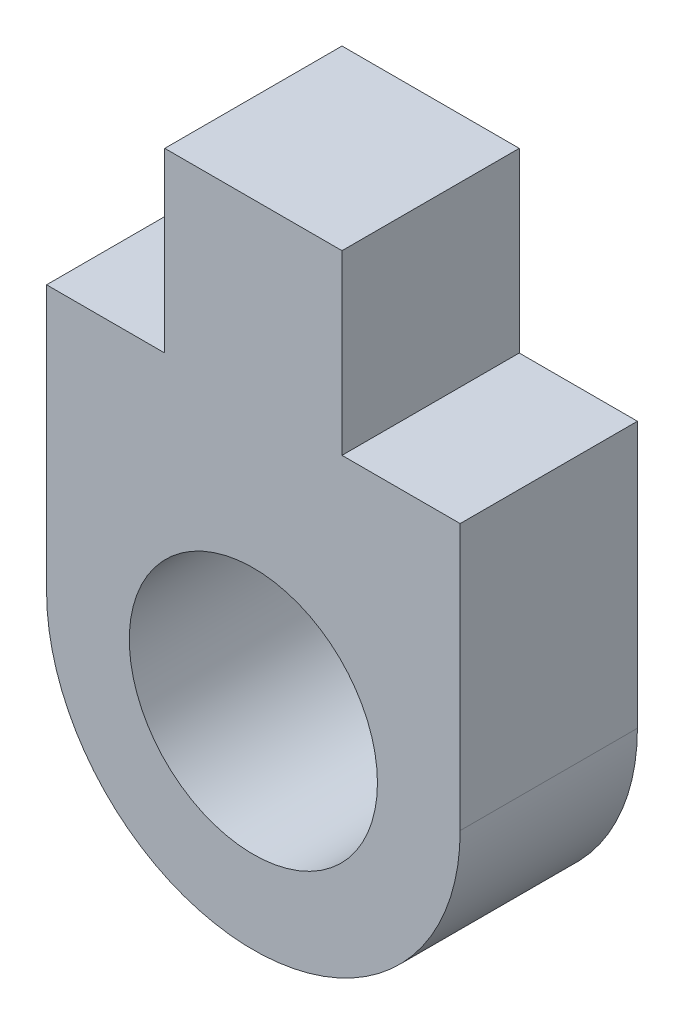
ISO-10303-21;
HEADER;
FILE_DESCRIPTION(('STEP AP214'),'2;1');
FILE_NAME('part.step','',(''),(''),'','','');
FILE_SCHEMA(('AUTOMOTIVE_DESIGN { 1 0 10303 214 1 1 1 1 }'));
ENDSEC;
DATA;
#1=APPLICATION_CONTEXT('core data for automotive mechanical design processes');
#2=APPLICATION_PROTOCOL_DEFINITION('international standard','automotive_design',2000,#1);
#3=PRODUCT_CONTEXT('',#1,'mechanical');
#4=PRODUCT('Part','Part','',(#3));
#5=PRODUCT_RELATED_PRODUCT_CATEGORY('part','',(#4));
#6=PRODUCT_DEFINITION_FORMATION('','',#4);
#7=PRODUCT_DEFINITION_CONTEXT('part definition',#1,'design');
#8=PRODUCT_DEFINITION('design','',#6,#7);
#9=PRODUCT_DEFINITION_SHAPE('','',#8);
#10=(LENGTH_UNIT() NAMED_UNIT(*) SI_UNIT(.MILLI.,.METRE.));
#11=(NAMED_UNIT(*) PLANE_ANGLE_UNIT() SI_UNIT($,.RADIAN.));
#12=(NAMED_UNIT(*) SI_UNIT($,.STERADIAN.) SOLID_ANGLE_UNIT());
#13=UNCERTAINTY_MEASURE_WITH_UNIT(LENGTH_MEASURE(1.E-05),#10,'distance_accuracy_value','');
#14=(GEOMETRIC_REPRESENTATION_CONTEXT(3) GLOBAL_UNCERTAINTY_ASSIGNED_CONTEXT((#13)) GLOBAL_UNIT_ASSIGNED_CONTEXT((#10,
#11,#12)) REPRESENTATION_CONTEXT('',''));
#15=CARTESIAN_POINT('',(0.,0.,0.));
#16=DIRECTION('',(0.,0.,1.));
#17=DIRECTION('',(1.,0.,0.));
#18=AXIS2_PLACEMENT_3D('',#15,#16,#17);
#19=CARTESIAN_POINT('',(-0.0999999999999996,-0.300000000000004,3.));
#20=DIRECTION('',(0.,0.,1.));
#21=DIRECTION('',(1.,0.,0.));
#22=AXIS2_PLACEMENT_3D('',#19,#20,#21);
#23=PLANE('',#22);
#24=CARTESIAN_POINT('',(-0.0999999999999996,-0.300000000000004,3.));
#25=DIRECTION('',(0.,0.,1.));
#26=DIRECTION('',(1.,0.,0.));
#27=AXIS2_PLACEMENT_3D('',#24,#25,#26);
#28=CIRCLE('',#27,3.5);
#29=CARTESIAN_POINT('',(-3.6,-0.300000000000004,3.));
#30=VERTEX_POINT('',#29);
#31=CARTESIAN_POINT('',(3.4,-0.300000000000004,3.));
#32=VERTEX_POINT('',#31);
#33=EDGE_CURVE('E145',#30,#32,#28,.T.);
#34=ORIENTED_EDGE('',*,*,#33,.T.);
#35=DIRECTION('',(0.,1.,0.));
#36=VECTOR('',#35,1.);
#37=CARTESIAN_POINT('',(3.4,-0.300000000000004,3.));
#38=LINE('',#37,#36);
#39=CARTESIAN_POINT('',(3.4,4.2,3.));
#40=VERTEX_POINT('',#39);
#41=EDGE_CURVE('E93',#32,#40,#38,.T.);
#42=ORIENTED_EDGE('',*,*,#41,.T.);
#43=DIRECTION('',(-1.,0.,0.));
#44=VECTOR('',#43,1.);
#45=CARTESIAN_POINT('',(3.4,4.2,3.));
#46=LINE('',#45,#44);
#47=CARTESIAN_POINT('',(1.4,4.2,3.));
#48=VERTEX_POINT('',#47);
#49=EDGE_CURVE('E160',#40,#48,#46,.T.);
#50=ORIENTED_EDGE('',*,*,#49,.T.);
#51=DIRECTION('',(0.,1.,0.));
#52=VECTOR('',#51,1.);
#53=CARTESIAN_POINT('',(1.4,4.2,3.));
#54=LINE('',#53,#52);
#55=CARTESIAN_POINT('',(1.4,7.2,3.));
#56=VERTEX_POINT('',#55);
#57=EDGE_CURVE('E173',#48,#56,#54,.T.);
#58=ORIENTED_EDGE('',*,*,#57,.T.);
#59=DIRECTION('',(-1.,0.,0.));
#60=VECTOR('',#59,1.);
#61=CARTESIAN_POINT('',(1.4,7.2,3.));
#62=LINE('',#61,#60);
#63=CARTESIAN_POINT('',(-1.6,7.2,3.));
#64=VERTEX_POINT('',#63);
#65=EDGE_CURVE('E112',#56,#64,#62,.T.);
#66=ORIENTED_EDGE('',*,*,#65,.T.);
#67=DIRECTION('',(0.,-1.,0.));
#68=VECTOR('',#67,1.);
#69=CARTESIAN_POINT('',(-1.6,4.2,3.));
#70=LINE('',#69,#68);
#71=CARTESIAN_POINT('',(-1.6,4.2,3.));
#72=VERTEX_POINT('',#71);
#73=EDGE_CURVE('E106',#64,#72,#70,.T.);
#74=ORIENTED_EDGE('',*,*,#73,.T.);
#75=DIRECTION('',(-1.,0.,0.));
#76=VECTOR('',#75,1.);
#77=CARTESIAN_POINT('',(-3.6,4.2,3.));
#78=LINE('',#77,#76);
#79=CARTESIAN_POINT('',(-3.6,4.2,3.));
#80=VERTEX_POINT('',#79);
#81=EDGE_CURVE('E110',#72,#80,#78,.T.);
#82=ORIENTED_EDGE('',*,*,#81,.T.);
#83=DIRECTION('',(0.,-1.,0.));
#84=VECTOR('',#83,1.);
#85=CARTESIAN_POINT('',(-3.6,4.2,3.));
#86=LINE('',#85,#84);
#87=EDGE_CURVE('E50',#80,#30,#86,.T.);
#88=ORIENTED_EDGE('',*,*,#87,.T.);
#89=EDGE_LOOP('',(#34,#42,#50,#58,#66,#74,#82,#88));
#90=FACE_BOUND('',#89,.T.);
#91=CARTESIAN_POINT('',(-0.0999999999999996,-0.300000000000004,3.));
#92=DIRECTION('',(0.,0.,1.));
#93=DIRECTION('',(1.,0.,0.));
#94=AXIS2_PLACEMENT_3D('',#91,#92,#93);
#95=CIRCLE('',#94,2.1);
#96=CARTESIAN_POINT('',(2.,-0.300000000000004,3.));
#97=VERTEX_POINT('',#96);
#98=EDGE_CURVE('E134',#97,#97,#95,.T.);
#99=ORIENTED_EDGE('',*,*,#98,.F.);
#100=EDGE_LOOP('',(#99));
#101=FACE_BOUND('',#100,.T.);
#102=ADVANCED_FACE('F33',(#90,#101),#23,.T.);
#103=CARTESIAN_POINT('',(-0.0999999999999996,-0.300000000000004,0.));
#104=DIRECTION('',(0.,0.,1.));
#105=DIRECTION('',(1.,0.,0.));
#106=AXIS2_PLACEMENT_3D('',#103,#104,#105);
#107=PLANE('',#106);
#108=CARTESIAN_POINT('',(-0.0999999999999996,-0.300000000000004,0.));
#109=DIRECTION('',(0.,0.,1.));
#110=DIRECTION('',(1.,0.,0.));
#111=AXIS2_PLACEMENT_3D('',#108,#109,#110);
#112=CIRCLE('',#111,3.5);
#113=CARTESIAN_POINT('',(-3.6,-0.300000000000004,0.));
#114=VERTEX_POINT('',#113);
#115=CARTESIAN_POINT('',(3.4,-0.300000000000004,0.));
#116=VERTEX_POINT('',#115);
#117=EDGE_CURVE('E130',#114,#116,#112,.T.);
#118=ORIENTED_EDGE('',*,*,#117,.F.);
#119=DIRECTION('',(0.,-1.,0.));
#120=VECTOR('',#119,1.);
#121=CARTESIAN_POINT('',(-3.6,4.2,0.));
#122=LINE('',#121,#120);
#123=CARTESIAN_POINT('',(-3.6,4.2,0.));
#124=VERTEX_POINT('',#123);
#125=EDGE_CURVE('E85',#124,#114,#122,.T.);
#126=ORIENTED_EDGE('',*,*,#125,.F.);
#127=DIRECTION('',(-1.,0.,0.));
#128=VECTOR('',#127,1.);
#129=CARTESIAN_POINT('',(-3.6,4.2,0.));
#130=LINE('',#129,#128);
#131=CARTESIAN_POINT('',(-1.6,4.2,0.));
#132=VERTEX_POINT('',#131);
#133=EDGE_CURVE('E79',#132,#124,#130,.T.);
#134=ORIENTED_EDGE('',*,*,#133,.F.);
#135=DIRECTION('',(0.,-1.,0.));
#136=VECTOR('',#135,1.);
#137=CARTESIAN_POINT('',(-1.6,4.2,0.));
#138=LINE('',#137,#136);
#139=CARTESIAN_POINT('',(-1.6,7.2,0.));
#140=VERTEX_POINT('',#139);
#141=EDGE_CURVE('E120',#140,#132,#138,.T.);
#142=ORIENTED_EDGE('',*,*,#141,.F.);
#143=DIRECTION('',(-1.,0.,0.));
#144=VECTOR('',#143,1.);
#145=CARTESIAN_POINT('',(1.4,7.2,0.));
#146=LINE('',#145,#144);
#147=CARTESIAN_POINT('',(1.4,7.2,0.));
#148=VERTEX_POINT('',#147);
#149=EDGE_CURVE('E140',#148,#140,#146,.T.);
#150=ORIENTED_EDGE('',*,*,#149,.F.);
#151=DIRECTION('',(0.,1.,0.));
#152=VECTOR('',#151,1.);
#153=CARTESIAN_POINT('',(1.4,4.2,0.));
#154=LINE('',#153,#152);
#155=CARTESIAN_POINT('',(1.4,4.2,0.));
#156=VERTEX_POINT('',#155);
#157=EDGE_CURVE('E138',#156,#148,#154,.T.);
#158=ORIENTED_EDGE('',*,*,#157,.F.);
#159=DIRECTION('',(-1.,0.,0.));
#160=VECTOR('',#159,1.);
#161=CARTESIAN_POINT('',(3.4,4.2,0.));
#162=LINE('',#161,#160);
#163=CARTESIAN_POINT('',(3.4,4.2,0.));
#164=VERTEX_POINT('',#163);
#165=EDGE_CURVE('E136',#164,#156,#162,.T.);
#166=ORIENTED_EDGE('',*,*,#165,.F.);
#167=DIRECTION('',(0.,1.,0.));
#168=VECTOR('',#167,1.);
#169=CARTESIAN_POINT('',(3.4,-0.300000000000004,0.));
#170=LINE('',#169,#168);
#171=EDGE_CURVE('E133',#116,#164,#170,.T.);
#172=ORIENTED_EDGE('',*,*,#171,.F.);
#173=EDGE_LOOP('',(#118,#126,#134,#142,#150,#158,#166,#172));
#174=FACE_BOUND('',#173,.T.);
#175=CARTESIAN_POINT('',(-0.0999999999999996,-0.300000000000004,0.));
#176=DIRECTION('',(0.,0.,1.));
#177=DIRECTION('',(1.,0.,0.));
#178=AXIS2_PLACEMENT_3D('',#175,#176,#177);
#179=CIRCLE('',#178,2.1);
#180=CARTESIAN_POINT('',(2.,-0.300000000000004,0.));
#181=VERTEX_POINT('',#180);
#182=EDGE_CURVE('E179',#181,#181,#179,.T.);
#183=ORIENTED_EDGE('',*,*,#182,.T.);
#184=EDGE_LOOP('',(#183));
#185=FACE_BOUND('',#184,.T.);
#186=ADVANCED_FACE('F164',(#174,#185),#107,.F.);
#187=CARTESIAN_POINT('',(-0.0999999999999996,-0.300000000000004,3.));
#188=DIRECTION('',(0.,0.,-1.));
#189=DIRECTION('',(-1.,0.,0.));
#190=AXIS2_PLACEMENT_3D('',#187,#188,#189);
#191=CYLINDRICAL_SURFACE('',#190,3.5);
#192=ORIENTED_EDGE('',*,*,#117,.T.);
#193=DIRECTION('',(0.,0.,-1.));
#194=VECTOR('',#193,1.);
#195=CARTESIAN_POINT('',(3.4,-0.300000000000004,3.));
#196=LINE('',#195,#194);
#197=EDGE_CURVE('E11',#32,#116,#196,.T.);
#198=ORIENTED_EDGE('',*,*,#197,.F.);
#199=ORIENTED_EDGE('',*,*,#33,.F.);
#200=DIRECTION('',(0.,0.,-1.));
#201=VECTOR('',#200,1.);
#202=CARTESIAN_POINT('',(-3.6,-0.300000000000004,3.));
#203=LINE('',#202,#201);
#204=EDGE_CURVE('E126',#30,#114,#203,.T.);
#205=ORIENTED_EDGE('',*,*,#204,.T.);
#206=EDGE_LOOP('',(#192,#198,#199,#205));
#207=FACE_BOUND('',#206,.T.);
#208=ADVANCED_FACE('F35',(#207),#191,.T.);
#209=CARTESIAN_POINT('',(3.4,-0.300000000000004,3.));
#210=DIRECTION('',(-1.,0.,0.));
#211=DIRECTION('',(0.,0.,1.));
#212=AXIS2_PLACEMENT_3D('',#209,#210,#211);
#213=PLANE('',#212);
#214=ORIENTED_EDGE('',*,*,#171,.T.);
#215=DIRECTION('',(0.,0.,-1.));
#216=VECTOR('',#215,1.);
#217=CARTESIAN_POINT('',(3.4,4.2,3.));
#218=LINE('',#217,#216);
#219=EDGE_CURVE('E42',#40,#164,#218,.T.);
#220=ORIENTED_EDGE('',*,*,#219,.F.);
#221=ORIENTED_EDGE('',*,*,#41,.F.);
#222=ORIENTED_EDGE('',*,*,#197,.T.);
#223=EDGE_LOOP('',(#214,#220,#221,#222));
#224=FACE_BOUND('',#223,.T.);
#225=ADVANCED_FACE('F207',(#224),#213,.F.);
#226=CARTESIAN_POINT('',(3.4,4.2,3.));
#227=DIRECTION('',(0.,-1.,0.));
#228=DIRECTION('',(0.,0.,-1.));
#229=AXIS2_PLACEMENT_3D('',#226,#227,#228);
#230=PLANE('',#229);
#231=ORIENTED_EDGE('',*,*,#165,.T.);
#232=DIRECTION('',(0.,0.,-1.));
#233=VECTOR('',#232,1.);
#234=CARTESIAN_POINT('',(1.4,4.2,3.));
#235=LINE('',#234,#233);
#236=EDGE_CURVE('E152',#48,#156,#235,.T.);
#237=ORIENTED_EDGE('',*,*,#236,.F.);
#238=ORIENTED_EDGE('',*,*,#49,.F.);
#239=ORIENTED_EDGE('',*,*,#219,.T.);
#240=EDGE_LOOP('',(#231,#237,#238,#239));
#241=FACE_BOUND('',#240,.T.);
#242=ADVANCED_FACE('F158',(#241),#230,.F.);
#243=CARTESIAN_POINT('',(1.4,4.2,3.));
#244=DIRECTION('',(-1.,0.,0.));
#245=DIRECTION('',(0.,0.,1.));
#246=AXIS2_PLACEMENT_3D('',#243,#244,#245);
#247=PLANE('',#246);
#248=ORIENTED_EDGE('',*,*,#157,.T.);
#249=DIRECTION('',(0.,0.,-1.));
#250=VECTOR('',#249,1.);
#251=CARTESIAN_POINT('',(1.4,7.2,3.));
#252=LINE('',#251,#250);
#253=EDGE_CURVE('E149',#56,#148,#252,.T.);
#254=ORIENTED_EDGE('',*,*,#253,.F.);
#255=ORIENTED_EDGE('',*,*,#57,.F.);
#256=ORIENTED_EDGE('',*,*,#236,.T.);
#257=EDGE_LOOP('',(#248,#254,#255,#256));
#258=FACE_BOUND('',#257,.T.);
#259=ADVANCED_FACE('F169',(#258),#247,.F.);
#260=CARTESIAN_POINT('',(1.4,7.2,3.));
#261=DIRECTION('',(0.,-1.,0.));
#262=DIRECTION('',(0.,0.,-1.));
#263=AXIS2_PLACEMENT_3D('',#260,#261,#262);
#264=PLANE('',#263);
#265=ORIENTED_EDGE('',*,*,#149,.T.);
#266=DIRECTION('',(0.,0.,-1.));
#267=VECTOR('',#266,1.);
#268=CARTESIAN_POINT('',(-1.6,7.2,3.));
#269=LINE('',#268,#267);
#270=EDGE_CURVE('E121',#64,#140,#269,.T.);
#271=ORIENTED_EDGE('',*,*,#270,.F.);
#272=ORIENTED_EDGE('',*,*,#65,.F.);
#273=ORIENTED_EDGE('',*,*,#253,.T.);
#274=EDGE_LOOP('',(#265,#271,#272,#273));
#275=FACE_BOUND('',#274,.T.);
#276=ADVANCED_FACE('F172',(#275),#264,.F.);
#277=CARTESIAN_POINT('',(-1.6,4.2,3.));
#278=DIRECTION('',(1.,0.,0.));
#279=DIRECTION('',(0.,1.,0.));
#280=AXIS2_PLACEMENT_3D('',#277,#278,#279);
#281=PLANE('',#280);
#282=ORIENTED_EDGE('',*,*,#141,.T.);
#283=DIRECTION('',(0.,0.,-1.));
#284=VECTOR('',#283,1.);
#285=CARTESIAN_POINT('',(-1.6,4.2,3.));
#286=LINE('',#285,#284);
#287=EDGE_CURVE('E117',#72,#132,#286,.T.);
#288=ORIENTED_EDGE('',*,*,#287,.F.);
#289=ORIENTED_EDGE('',*,*,#73,.F.);
#290=ORIENTED_EDGE('',*,*,#270,.T.);
#291=EDGE_LOOP('',(#282,#288,#289,#290));
#292=FACE_BOUND('',#291,.T.);
#293=ADVANCED_FACE('F118',(#292),#281,.F.);
#294=CARTESIAN_POINT('',(-3.6,4.2,3.));
#295=DIRECTION('',(0.,-1.,0.));
#296=DIRECTION('',(0.,0.,-1.));
#297=AXIS2_PLACEMENT_3D('',#294,#295,#296);
#298=PLANE('',#297);
#299=ORIENTED_EDGE('',*,*,#133,.T.);
#300=DIRECTION('',(0.,0.,-1.));
#301=VECTOR('',#300,1.);
#302=CARTESIAN_POINT('',(-3.6,4.2,3.));
#303=LINE('',#302,#301);
#304=EDGE_CURVE('E122',#80,#124,#303,.T.);
#305=ORIENTED_EDGE('',*,*,#304,.F.);
#306=ORIENTED_EDGE('',*,*,#81,.F.);
#307=ORIENTED_EDGE('',*,*,#287,.T.);
#308=EDGE_LOOP('',(#299,#305,#306,#307));
#309=FACE_BOUND('',#308,.T.);
#310=ADVANCED_FACE('F124',(#309),#298,.F.);
#311=CARTESIAN_POINT('',(-3.6,4.2,3.));
#312=DIRECTION('',(1.,0.,0.));
#313=DIRECTION('',(0.,0.,-1.));
#314=AXIS2_PLACEMENT_3D('',#311,#312,#313);
#315=PLANE('',#314);
#316=ORIENTED_EDGE('',*,*,#125,.T.);
#317=ORIENTED_EDGE('',*,*,#204,.F.);
#318=ORIENTED_EDGE('',*,*,#87,.F.);
#319=ORIENTED_EDGE('',*,*,#304,.T.);
#320=EDGE_LOOP('',(#316,#317,#318,#319));
#321=FACE_BOUND('',#320,.T.);
#322=ADVANCED_FACE('F195',(#321),#315,.F.);
#323=CARTESIAN_POINT('',(-0.0999999999999996,-0.300000000000004,3.));
#324=DIRECTION('',(0.,0.,-1.));
#325=DIRECTION('',(-1.,0.,0.));
#326=AXIS2_PLACEMENT_3D('',#323,#324,#325);
#327=CYLINDRICAL_SURFACE('',#326,2.1);
#328=ORIENTED_EDGE('',*,*,#98,.T.);
#329=EDGE_LOOP('',(#328));
#330=FACE_BOUND('',#329,.T.);
#331=ORIENTED_EDGE('',*,*,#182,.F.);
#332=EDGE_LOOP('',(#331));
#333=FACE_BOUND('',#332,.T.);
#334=ADVANCED_FACE('F185',(#330,#333),#327,.F.);
#335=CLOSED_SHELL('',(#102,#186,#208,#225,#242,#259,#276,#293,#310,#322,#334));
#336=MANIFOLD_SOLID_BREP('B2',#335);
#337=ADVANCED_BREP_SHAPE_REPRESENTATION('',(#18,#336),#14);
#338=SHAPE_DEFINITION_REPRESENTATION(#9,#337);
ENDSEC;
END-ISO-10303-21;
